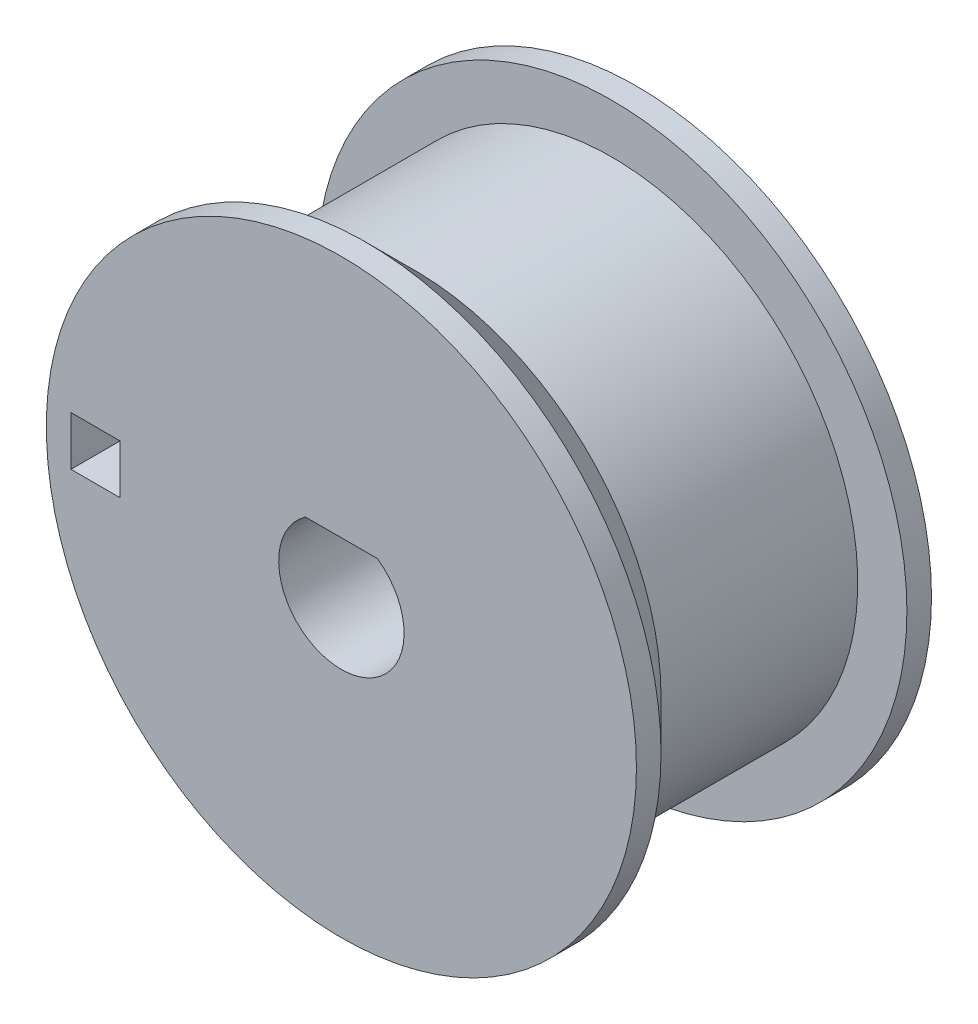
ISO-10303-21;
HEADER;
FILE_DESCRIPTION(('STEP AP214'),'2;1');
FILE_NAME('part.step','',(''),(''),'','','');
FILE_SCHEMA(('AUTOMOTIVE_DESIGN { 1 0 10303 214 1 1 1 1 }'));
ENDSEC;
DATA;
#1=APPLICATION_CONTEXT('core data for automotive mechanical design processes');
#2=APPLICATION_PROTOCOL_DEFINITION('international standard','automotive_design',2000,#1);
#3=PRODUCT_CONTEXT('',#1,'mechanical');
#4=PRODUCT('Part','Part','',(#3));
#5=PRODUCT_RELATED_PRODUCT_CATEGORY('part','',(#4));
#6=PRODUCT_DEFINITION_FORMATION('','',#4);
#7=PRODUCT_DEFINITION_CONTEXT('part definition',#1,'design');
#8=PRODUCT_DEFINITION('design','',#6,#7);
#9=PRODUCT_DEFINITION_SHAPE('','',#8);
#10=(LENGTH_UNIT() NAMED_UNIT(*) SI_UNIT(.MILLI.,.METRE.));
#11=(NAMED_UNIT(*) PLANE_ANGLE_UNIT() SI_UNIT($,.RADIAN.));
#12=(NAMED_UNIT(*) SI_UNIT($,.STERADIAN.) SOLID_ANGLE_UNIT());
#13=UNCERTAINTY_MEASURE_WITH_UNIT(LENGTH_MEASURE(1.E-05),#10,'distance_accuracy_value','');
#14=(GEOMETRIC_REPRESENTATION_CONTEXT(3) GLOBAL_UNCERTAINTY_ASSIGNED_CONTEXT((#13)) GLOBAL_UNIT_ASSIGNED_CONTEXT((#10,
#11,#12)) REPRESENTATION_CONTEXT('',''));
#15=CARTESIAN_POINT('',(0.,0.,0.));
#16=DIRECTION('',(0.,0.,1.));
#17=DIRECTION('',(1.,0.,0.));
#18=AXIS2_PLACEMENT_3D('',#15,#16,#17);
#19=CARTESIAN_POINT('',(-1.42912560679596,-37.91,332.000000000001));
#20=DIRECTION('',(0.,-1.,0.));
#21=DIRECTION('',(1.,0.,0.));
#22=AXIS2_PLACEMENT_3D('',#19,#20,#21);
#23=PLANE('',#22);
#24=DIRECTION('',(1.,0.,0.));
#25=VECTOR('',#24,1.);
#26=CARTESIAN_POINT('',(0.,-37.91,344.000000000001));
#27=LINE('',#26,#25);
#28=CARTESIAN_POINT('',(1.46095858942,-37.91,344.000000000001));
#29=VERTEX_POINT('',#28);
#30=CARTESIAN_POINT('',(-1.46095858941995,-37.91,344.000000000001));
#31=VERTEX_POINT('',#30);
#32=EDGE_CURVE('E139',#29,#31,#27,.F.);
#33=ORIENTED_EDGE('',*,*,#32,.T.);
#34=DIRECTION('',(0.,0.,1.));
#35=VECTOR('',#34,1.);
#36=CARTESIAN_POINT('',(-1.46095858941995,-37.91,332.000000000001));
#37=LINE('',#36,#35);
#38=CARTESIAN_POINT('',(-1.46095858941995,-37.91,332.000000000001));
#39=VERTEX_POINT('',#38);
#40=EDGE_CURVE('E70',#31,#39,#37,.F.);
#41=ORIENTED_EDGE('',*,*,#40,.T.);
#42=DIRECTION('',(1.,0.,0.));
#43=VECTOR('',#42,1.);
#44=CARTESIAN_POINT('',(0.,-37.91,332.000000000001));
#45=LINE('',#44,#43);
#46=CARTESIAN_POINT('',(1.46095858942,-37.91,332.000000000001));
#47=VERTEX_POINT('',#46);
#48=EDGE_CURVE('E83',#47,#39,#45,.F.);
#49=ORIENTED_EDGE('',*,*,#48,.F.);
#50=DIRECTION('',(0.,0.,1.));
#51=VECTOR('',#50,1.);
#52=CARTESIAN_POINT('',(1.46095858942,-37.91,332.000000000001));
#53=LINE('',#52,#51);
#54=EDGE_CURVE('E75',#47,#29,#53,.T.);
#55=ORIENTED_EDGE('',*,*,#54,.T.);
#56=EDGE_LOOP('',(#33,#41,#49,#55));
#57=FACE_BOUND('',#56,.T.);
#58=ADVANCED_FACE('F16',(#57),#23,.T.);
#59=CARTESIAN_POINT('',(0.,-40.,332.000000000001));
#60=DIRECTION('',(0.,0.,1.));
#61=DIRECTION('',(1.,0.,0.));
#62=AXIS2_PLACEMENT_3D('',#59,#60,#61);
#63=CYLINDRICAL_SURFACE('',#62,2.55);
#64=ORIENTED_EDGE('',*,*,#40,.F.);
#65=CARTESIAN_POINT('',(0.,-40.,344.000000000001));
#66=DIRECTION('',(0.,0.,1.));
#67=DIRECTION('',(1.,0.,0.));
#68=AXIS2_PLACEMENT_3D('',#65,#66,#67);
#69=CIRCLE('',#68,2.55);
#70=EDGE_CURVE('E80',#31,#29,#69,.T.);
#71=ORIENTED_EDGE('',*,*,#70,.T.);
#72=ORIENTED_EDGE('',*,*,#54,.F.);
#73=CARTESIAN_POINT('',(0.,-40.,332.000000000001));
#74=DIRECTION('',(0.,0.,1.));
#75=DIRECTION('',(1.,0.,0.));
#76=AXIS2_PLACEMENT_3D('',#73,#74,#75);
#77=CIRCLE('',#76,2.55);
#78=EDGE_CURVE('E19',#39,#47,#77,.T.);
#79=ORIENTED_EDGE('',*,*,#78,.F.);
#80=EDGE_LOOP('',(#64,#71,#72,#79));
#81=FACE_BOUND('',#80,.T.);
#82=ADVANCED_FACE('F76',(#81),#63,.F.);
#83=CARTESIAN_POINT('',(0.,-40.,343.000000000001));
#84=DIRECTION('',(0.,0.,1.));
#85=DIRECTION('',(1.,0.,0.));
#86=AXIS2_PLACEMENT_3D('',#83,#84,#85);
#87=CYLINDRICAL_SURFACE('',#86,12.);
#88=CARTESIAN_POINT('',(0.,-40.,343.000000000001));
#89=DIRECTION('',(0.,0.,1.));
#90=DIRECTION('',(1.,0.,0.));
#91=AXIS2_PLACEMENT_3D('',#88,#89,#90);
#92=CIRCLE('',#91,12.);
#93=CARTESIAN_POINT('',(12.,-40.,343.000000000001));
#94=VERTEX_POINT('',#93);
#95=EDGE_CURVE('E132',#94,#94,#92,.F.);
#96=ORIENTED_EDGE('',*,*,#95,.F.);
#97=EDGE_LOOP('',(#96));
#98=FACE_BOUND('',#97,.T.);
#99=CARTESIAN_POINT('',(0.,-40.,344.000000000001));
#100=DIRECTION('',(0.,0.,1.));
#101=DIRECTION('',(1.,0.,0.));
#102=AXIS2_PLACEMENT_3D('',#99,#100,#101);
#103=CIRCLE('',#102,12.);
#104=CARTESIAN_POINT('',(12.,-40.,344.000000000001));
#105=VERTEX_POINT('',#104);
#106=EDGE_CURVE('E140',#105,#105,#103,.F.);
#107=ORIENTED_EDGE('',*,*,#106,.T.);
#108=EDGE_LOOP('',(#107));
#109=FACE_BOUND('',#108,.T.);
#110=ADVANCED_FACE('F348',(#98,#109),#87,.T.);
#111=CARTESIAN_POINT('',(0.,-40.,332.000000000001));
#112=DIRECTION('',(0.,0.,-1.));
#113=DIRECTION('',(0.,1.,0.));
#114=AXIS2_PLACEMENT_3D('',#111,#112,#113);
#115=PLANE('',#114);
#116=ORIENTED_EDGE('',*,*,#78,.T.);
#117=ORIENTED_EDGE('',*,*,#48,.T.);
#118=EDGE_LOOP('',(#116,#117));
#119=FACE_BOUND('',#118,.T.);
#120=DIRECTION('',(0.,1.,0.));
#121=VECTOR('',#120,1.);
#122=CARTESIAN_POINT('',(-8.99999999999997,-39.,332.000000000001));
#123=LINE('',#122,#121);
#124=CARTESIAN_POINT('',(-8.99999999999997,-41.,332.000000000001));
#125=VERTEX_POINT('',#124);
#126=CARTESIAN_POINT('',(-8.99999999999997,-39.,332.000000000001));
#127=VERTEX_POINT('',#126);
#128=EDGE_CURVE('E85',#125,#127,#123,.T.);
#129=ORIENTED_EDGE('',*,*,#128,.T.);
#130=DIRECTION('',(-1.,0.,0.));
#131=VECTOR('',#130,1.);
#132=CARTESIAN_POINT('',(-11.,-39.,332.000000000001));
#133=LINE('',#132,#131);
#134=CARTESIAN_POINT('',(-11.,-39.,332.000000000001));
#135=VERTEX_POINT('',#134);
#136=EDGE_CURVE('E178',#127,#135,#133,.T.);
#137=ORIENTED_EDGE('',*,*,#136,.T.);
#138=DIRECTION('',(0.,-1.,0.));
#139=VECTOR('',#138,1.);
#140=CARTESIAN_POINT('',(-11.,-41.,332.000000000001));
#141=LINE('',#140,#139);
#142=CARTESIAN_POINT('',(-11.,-41.,332.000000000001));
#143=VERTEX_POINT('',#142);
#144=EDGE_CURVE('E137',#135,#143,#141,.T.);
#145=ORIENTED_EDGE('',*,*,#144,.T.);
#146=DIRECTION('',(1.,0.,0.));
#147=VECTOR('',#146,1.);
#148=CARTESIAN_POINT('',(-8.99999999999997,-41.,332.000000000001));
#149=LINE('',#148,#147);
#150=EDGE_CURVE('E160',#143,#125,#149,.T.);
#151=ORIENTED_EDGE('',*,*,#150,.T.);
#152=EDGE_LOOP('',(#129,#137,#145,#151));
#153=FACE_BOUND('',#152,.T.);
#154=CARTESIAN_POINT('',(0.,-40.,332.000000000001));
#155=DIRECTION('',(0.,0.,1.));
#156=DIRECTION('',(1.,0.,0.));
#157=AXIS2_PLACEMENT_3D('',#154,#155,#156);
#158=CIRCLE('',#157,12.);
#159=CARTESIAN_POINT('',(12.,-40.,332.000000000001));
#160=VERTEX_POINT('',#159);
#161=EDGE_CURVE('E134',#160,#160,#158,.T.);
#162=ORIENTED_EDGE('',*,*,#161,.F.);
#163=EDGE_LOOP('',(#162));
#164=FACE_BOUND('',#163,.T.);
#165=ADVANCED_FACE('F87',(#119,#153,#164),#115,.T.);
#166=CARTESIAN_POINT('',(-8.99999999999997,-39.,344.000000000001));
#167=DIRECTION('',(1.,0.,0.));
#168=DIRECTION('',(0.,1.,0.));
#169=AXIS2_PLACEMENT_3D('',#166,#167,#168);
#170=PLANE('',#169);
#171=DIRECTION('',(0.,0.,-1.));
#172=VECTOR('',#171,1.);
#173=CARTESIAN_POINT('',(-8.99999999999997,-41.,344.000000000001));
#174=LINE('',#173,#172);
#175=CARTESIAN_POINT('',(-8.99999999999997,-41.,344.000000000001));
#176=VERTEX_POINT('',#175);
#177=EDGE_CURVE('E162',#125,#176,#174,.F.);
#178=ORIENTED_EDGE('',*,*,#177,.T.);
#179=DIRECTION('',(0.,1.,0.));
#180=VECTOR('',#179,1.);
#181=CARTESIAN_POINT('',(-8.99999999999997,-40.,344.000000000001));
#182=LINE('',#181,#180);
#183=CARTESIAN_POINT('',(-8.99999999999997,-39.,344.000000000001));
#184=VERTEX_POINT('',#183);
#185=EDGE_CURVE('E142',#176,#184,#182,.T.);
#186=ORIENTED_EDGE('',*,*,#185,.T.);
#187=DIRECTION('',(0.,0.,1.));
#188=VECTOR('',#187,1.);
#189=CARTESIAN_POINT('',(-8.99999999999997,-39.,344.000000000001));
#190=LINE('',#189,#188);
#191=EDGE_CURVE('E180',#184,#127,#190,.F.);
#192=ORIENTED_EDGE('',*,*,#191,.T.);
#193=ORIENTED_EDGE('',*,*,#128,.F.);
#194=EDGE_LOOP('',(#178,#186,#192,#193));
#195=FACE_BOUND('',#194,.T.);
#196=ADVANCED_FACE('F207',(#195),#170,.F.);
#197=CARTESIAN_POINT('',(0.,-40.,344.000000000001));
#198=DIRECTION('',(0.,0.,-1.));
#199=DIRECTION('',(0.,1.,0.));
#200=AXIS2_PLACEMENT_3D('',#197,#198,#199);
#201=PLANE('',#200);
#202=ORIENTED_EDGE('',*,*,#32,.F.);
#203=ORIENTED_EDGE('',*,*,#70,.F.);
#204=EDGE_LOOP('',(#202,#203));
#205=FACE_BOUND('',#204,.T.);
#206=DIRECTION('',(-1.,0.,0.));
#207=VECTOR('',#206,1.);
#208=CARTESIAN_POINT('',(-11.,-39.,344.000000000001));
#209=LINE('',#208,#207);
#210=CARTESIAN_POINT('',(-11.,-39.,344.000000000001));
#211=VERTEX_POINT('',#210);
#212=EDGE_CURVE('E175',#211,#184,#209,.F.);
#213=ORIENTED_EDGE('',*,*,#212,.T.);
#214=ORIENTED_EDGE('',*,*,#185,.F.);
#215=DIRECTION('',(1.,0.,0.));
#216=VECTOR('',#215,1.);
#217=CARTESIAN_POINT('',(-8.99999999999997,-41.,344.000000000001));
#218=LINE('',#217,#216);
#219=CARTESIAN_POINT('',(-11.,-41.,344.000000000001));
#220=VERTEX_POINT('',#219);
#221=EDGE_CURVE('E256',#176,#220,#218,.F.);
#222=ORIENTED_EDGE('',*,*,#221,.T.);
#223=DIRECTION('',(0.,-1.,0.));
#224=VECTOR('',#223,1.);
#225=CARTESIAN_POINT('',(-11.,-41.,344.000000000001));
#226=LINE('',#225,#224);
#227=EDGE_CURVE('E138',#220,#211,#226,.F.);
#228=ORIENTED_EDGE('',*,*,#227,.T.);
#229=EDGE_LOOP('',(#213,#214,#222,#228));
#230=FACE_BOUND('',#229,.T.);
#231=ORIENTED_EDGE('',*,*,#106,.F.);
#232=EDGE_LOOP('',(#231));
#233=FACE_BOUND('',#232,.T.);
#234=ADVANCED_FACE('F194',(#205,#230,#233),#201,.F.);
#235=CARTESIAN_POINT('',(-11.,-41.,344.000000000001));
#236=DIRECTION('',(-1.,0.,0.));
#237=DIRECTION('',(0.,-1.,0.));
#238=AXIS2_PLACEMENT_3D('',#235,#236,#237);
#239=PLANE('',#238);
#240=DIRECTION('',(0.,0.,1.));
#241=VECTOR('',#240,1.);
#242=CARTESIAN_POINT('',(-11.,-39.,344.000000000001));
#243=LINE('',#242,#241);
#244=CARTESIAN_POINT('',(-11.,-39.0000000094459,342.045361016333));
#245=VERTEX_POINT('',#244);
#246=EDGE_CURVE('E168',#245,#211,#243,.T.);
#247=ORIENTED_EDGE('',*,*,#246,.T.);
#248=ORIENTED_EDGE('',*,*,#227,.F.);
#249=DIRECTION('',(0.,0.,-1.));
#250=VECTOR('',#249,1.);
#251=CARTESIAN_POINT('',(-11.,-41.,344.000000000001));
#252=LINE('',#251,#250);
#253=CARTESIAN_POINT('',(-11.,-40.9999999968515,342.045361016903));
#254=VERTEX_POINT('',#253);
#255=EDGE_CURVE('E104',#220,#254,#252,.T.);
#256=ORIENTED_EDGE('',*,*,#255,.T.);
#257=CARTESIAN_POINT('',(-10.9999999295796,-39.0000000215371,342.045361044697));
#258=CARTESIAN_POINT('',(-10.9999999647898,-39.3333333474743,342.015120353124));
#259=CARTESIAN_POINT('',(-10.9999999882633,-39.6666666736286,342.000000004892));
#260=CARTESIAN_POINT('',(-11.0000000117367,-40.3333333310173,341.999999995111));
#261=CARTESIAN_POINT('',(-11.0000000117367,-40.6666666622516,342.015120333983));
#262=CARTESIAN_POINT('',(-11.,-40.9999999937029,342.045361016618));
#263=B_SPLINE_CURVE_WITH_KNOTS('',3,(#257,#258,#259,#260,#261,#262),.UNSPECIFIED.,.F.,.F.,(4,2,
4),(0.,1.00102826198951,2.002056537931),.UNSPECIFIED.);
#264=EDGE_CURVE('E105',#245,#254,#263,.T.);
#265=ORIENTED_EDGE('',*,*,#264,.F.);
#266=EDGE_LOOP('',(#247,#248,#256,#265));
#267=FACE_BOUND('',#266,.T.);
#268=ADVANCED_FACE('F275',(#267),#239,.F.);
#269=CARTESIAN_POINT('',(0.,-40.,332.000000000001));
#270=DIRECTION('',(0.,0.,1.));
#271=DIRECTION('',(1.,0.,0.));
#272=AXIS2_PLACEMENT_3D('',#269,#270,#271);
#273=CYLINDRICAL_SURFACE('',#272,12.);
#274=ORIENTED_EDGE('',*,*,#161,.T.);
#275=EDGE_LOOP('',(#274));
#276=FACE_BOUND('',#275,.T.);
#277=CARTESIAN_POINT('',(0.,-40.,333.000000000001));
#278=DIRECTION('',(0.,0.,1.));
#279=DIRECTION('',(1.,0.,0.));
#280=AXIS2_PLACEMENT_3D('',#277,#278,#279);
#281=CIRCLE('',#280,12.);
#282=CARTESIAN_POINT('',(12.,-40.,333.000000000001));
#283=VERTEX_POINT('',#282);
#284=EDGE_CURVE('E92',#283,#283,#281,.F.);
#285=ORIENTED_EDGE('',*,*,#284,.T.);
#286=EDGE_LOOP('',(#285));
#287=FACE_BOUND('',#286,.T.);
#288=ADVANCED_FACE('F277',(#276,#287),#273,.T.);
#289=CARTESIAN_POINT('',(-11.,-41.,344.000000000001));
#290=DIRECTION('',(-1.,0.,0.));
#291=DIRECTION('',(0.,-1.,0.));
#292=AXIS2_PLACEMENT_3D('',#289,#290,#291);
#293=PLANE('',#292);
#294=DIRECTION('',(0.,0.,-1.));
#295=VECTOR('',#294,1.);
#296=CARTESIAN_POINT('',(-11.,-41.,344.000000000001));
#297=LINE('',#296,#295);
#298=CARTESIAN_POINT('',(-11.,-41.,333.000000000001));
#299=VERTEX_POINT('',#298);
#300=EDGE_CURVE('E163',#299,#143,#297,.T.);
#301=ORIENTED_EDGE('',*,*,#300,.T.);
#302=ORIENTED_EDGE('',*,*,#144,.F.);
#303=DIRECTION('',(0.,0.,1.));
#304=VECTOR('',#303,1.);
#305=CARTESIAN_POINT('',(-11.,-39.,344.000000000001));
#306=LINE('',#305,#304);
#307=CARTESIAN_POINT('',(-11.,-39.,333.000000000001));
#308=VERTEX_POINT('',#307);
#309=EDGE_CURVE('E133',#135,#308,#306,.T.);
#310=ORIENTED_EDGE('',*,*,#309,.T.);
#311=DIRECTION('',(0.,1.,0.));
#312=VECTOR('',#311,1.);
#313=CARTESIAN_POINT('',(-11.,-40.,333.000000000001));
#314=LINE('',#313,#312);
#315=EDGE_CURVE('E95',#308,#299,#314,.F.);
#316=ORIENTED_EDGE('',*,*,#315,.T.);
#317=EDGE_LOOP('',(#301,#302,#310,#316));
#318=FACE_BOUND('',#317,.T.);
#319=ADVANCED_FACE('F221',(#318),#293,.F.);
#320=CARTESIAN_POINT('',(-11.,-39.,344.000000000001));
#321=DIRECTION('',(0.,1.,0.));
#322=DIRECTION('',(-1.,0.,0.));
#323=AXIS2_PLACEMENT_3D('',#320,#321,#322);
#324=PLANE('',#323);
#325=DIRECTION('',(0.,0.,1.));
#326=VECTOR('',#325,1.);
#327=CARTESIAN_POINT('',(-9.94987437106617,-39.,332.000000000001));
#328=LINE('',#327,#326);
#329=CARTESIAN_POINT('',(-9.94987437106617,-39.,333.000000000001));
#330=VERTEX_POINT('',#329);
#331=CARTESIAN_POINT('',(-9.94987437106617,-39.,341.000000000001));
#332=VERTEX_POINT('',#331);
#333=EDGE_CURVE('E235',#330,#332,#328,.T.);
#334=ORIENTED_EDGE('',*,*,#333,.F.);
#335=DIRECTION('',(1.,0.,0.));
#336=VECTOR('',#335,1.);
#337=CARTESIAN_POINT('',(0.,-39.,333.000000000001));
#338=LINE('',#337,#336);
#339=EDGE_CURVE('E233',#330,#308,#338,.F.);
#340=ORIENTED_EDGE('',*,*,#339,.T.);
#341=ORIENTED_EDGE('',*,*,#309,.F.);
#342=ORIENTED_EDGE('',*,*,#136,.F.);
#343=ORIENTED_EDGE('',*,*,#191,.F.);
#344=ORIENTED_EDGE('',*,*,#212,.F.);
#345=ORIENTED_EDGE('',*,*,#246,.F.);
#346=CARTESIAN_POINT('',(-9.94987437106618,-39.,341.000000000001));
#347=CARTESIAN_POINT('',(-10.1249348197619,-39.,341.174187098746));
#348=CARTESIAN_POINT('',(-10.2999755014829,-39.,341.348394054561));
#349=CARTESIAN_POINT('',(-10.6500173307518,-39.,341.696847680108));
#350=CARTESIAN_POINT('',(-10.8250184782998,-39.,341.87109434984));
#351=CARTESIAN_POINT('',(-10.9999998588731,-39.,342.045360876641));
#352=B_SPLINE_CURVE_WITH_KNOTS('',3,(#346,#347,#348,#349,#350,#351),.UNSPECIFIED.,.F.,.F.,(4,2,
4),(0.,0.74086822944775,1.48173645794809),.UNSPECIFIED.);
#353=EDGE_CURVE('E125',#332,#245,#352,.T.);
#354=ORIENTED_EDGE('',*,*,#353,.F.);
#355=EDGE_LOOP('',(#334,#340,#341,#342,#343,#344,#345,#354));
#356=FACE_BOUND('',#355,.T.);
#357=ADVANCED_FACE('F119',(#356),#324,.F.);
#358=CARTESIAN_POINT('',(0.,-40.,343.000000000001));
#359=DIRECTION('',(0.,0.,1.));
#360=DIRECTION('',(1.,0.,0.));
#361=AXIS2_PLACEMENT_3D('',#358,#359,#360);
#362=CONICAL_SURFACE('',#361,12.,0.785398163397442);
#363=ORIENTED_EDGE('',*,*,#95,.T.);
#364=EDGE_LOOP('',(#363));
#365=FACE_BOUND('',#364,.T.);
#366=CARTESIAN_POINT('',(-10.9999999894881,-41.0000000108235,342.045360992393));
#367=CARTESIAN_POINT('',(-10.8250185847668,-41.0000000054118,341.871094448689));
#368=CARTESIAN_POINT('',(-10.6500174142603,-41.0000000018039,341.69684776086));
#369=CARTESIAN_POINT('',(-10.2999755414531,-40.9999999981961,341.348394096729));
#370=CARTESIAN_POINT('',(-10.1249348391522,-40.9999999981961,341.174187120427));
#371=CARTESIAN_POINT('',(-9.94987437106617,-41.,341.000000000001));
#372=B_SPLINE_CURVE_WITH_KNOTS('',3,(#366,#367,#368,#369,#370,#371),.UNSPECIFIED.,.F.,.F.,(4,2,
4),(0.,0.740868315614723,1.48173663217793),.UNSPECIFIED.);
#373=CARTESIAN_POINT('',(-9.94987437106617,-41.,341.000000000001));
#374=VERTEX_POINT('',#373);
#375=EDGE_CURVE('E96',#254,#374,#372,.T.);
#376=ORIENTED_EDGE('',*,*,#375,.T.);
#377=CARTESIAN_POINT('',(0.,-40.,341.000000000001));
#378=DIRECTION('',(0.,0.,1.));
#379=DIRECTION('',(1.,0.,0.));
#380=AXIS2_PLACEMENT_3D('',#377,#378,#379);
#381=CIRCLE('',#380,10.);
#382=EDGE_CURVE('E243',#332,#374,#381,.F.);
#383=ORIENTED_EDGE('',*,*,#382,.F.);
#384=ORIENTED_EDGE('',*,*,#353,.T.);
#385=ORIENTED_EDGE('',*,*,#264,.T.);
#386=EDGE_LOOP('',(#376,#383,#384,#385));
#387=FACE_BOUND('',#386,.T.);
#388=ADVANCED_FACE('F115',(#365,#387),#362,.T.);
#389=CARTESIAN_POINT('',(-8.99999999999997,-41.,344.000000000001));
#390=DIRECTION('',(0.,-1.,0.));
#391=DIRECTION('',(0.,0.,-1.));
#392=AXIS2_PLACEMENT_3D('',#389,#390,#391);
#393=PLANE('',#392);
#394=ORIENTED_EDGE('',*,*,#255,.F.);
#395=ORIENTED_EDGE('',*,*,#221,.F.);
#396=ORIENTED_EDGE('',*,*,#177,.F.);
#397=ORIENTED_EDGE('',*,*,#150,.F.);
#398=ORIENTED_EDGE('',*,*,#300,.F.);
#399=DIRECTION('',(1.,0.,0.));
#400=VECTOR('',#399,1.);
#401=CARTESIAN_POINT('',(0.,-41.,333.000000000001));
#402=LINE('',#401,#400);
#403=CARTESIAN_POINT('',(-9.94987437106617,-41.,333.000000000001));
#404=VERTEX_POINT('',#403);
#405=EDGE_CURVE('E34',#299,#404,#402,.T.);
#406=ORIENTED_EDGE('',*,*,#405,.T.);
#407=DIRECTION('',(0.,0.,1.));
#408=VECTOR('',#407,1.);
#409=CARTESIAN_POINT('',(-9.94987437106617,-41.,332.000000000001));
#410=LINE('',#409,#408);
#411=EDGE_CURVE('E25',#374,#404,#410,.F.);
#412=ORIENTED_EDGE('',*,*,#411,.F.);
#413=ORIENTED_EDGE('',*,*,#375,.F.);
#414=EDGE_LOOP('',(#394,#395,#396,#397,#398,#406,#412,#413));
#415=FACE_BOUND('',#414,.T.);
#416=ADVANCED_FACE('F112',(#415),#393,.F.);
#417=CARTESIAN_POINT('',(0.,-40.,333.000000000001));
#418=DIRECTION('',(0.,0.,-1.));
#419=DIRECTION('',(0.,1.,0.));
#420=AXIS2_PLACEMENT_3D('',#417,#418,#419);
#421=PLANE('',#420);
#422=CARTESIAN_POINT('',(0.,-40.,333.000000000001));
#423=DIRECTION('',(0.,0.,1.));
#424=DIRECTION('',(1.,0.,0.));
#425=AXIS2_PLACEMENT_3D('',#422,#423,#424);
#426=CIRCLE('',#425,10.);
#427=EDGE_CURVE('E11',#404,#330,#426,.T.);
#428=ORIENTED_EDGE('',*,*,#427,.F.);
#429=ORIENTED_EDGE('',*,*,#405,.F.);
#430=ORIENTED_EDGE('',*,*,#315,.F.);
#431=ORIENTED_EDGE('',*,*,#339,.F.);
#432=EDGE_LOOP('',(#428,#429,#430,#431));
#433=FACE_BOUND('',#432,.T.);
#434=ORIENTED_EDGE('',*,*,#284,.F.);
#435=EDGE_LOOP('',(#434));
#436=FACE_BOUND('',#435,.T.);
#437=ADVANCED_FACE('F230',(#433,#436),#421,.F.);
#438=CARTESIAN_POINT('',(0.,-40.,332.000000000001));
#439=DIRECTION('',(0.,0.,1.));
#440=DIRECTION('',(1.,0.,0.));
#441=AXIS2_PLACEMENT_3D('',#438,#439,#440);
#442=CYLINDRICAL_SURFACE('',#441,10.);
#443=ORIENTED_EDGE('',*,*,#411,.T.);
#444=ORIENTED_EDGE('',*,*,#427,.T.);
#445=ORIENTED_EDGE('',*,*,#333,.T.);
#446=ORIENTED_EDGE('',*,*,#382,.T.);
#447=EDGE_LOOP('',(#443,#444,#445,#446));
#448=FACE_BOUND('',#447,.T.);
#449=ADVANCED_FACE('F269',(#448),#442,.T.);
#450=CLOSED_SHELL('',(#58,#82,#110,#165,#196,#234,#268,#288,#319,#357,#388,#416,#437,#449));
#451=MANIFOLD_SOLID_BREP('B1',#450);
#452=ADVANCED_BREP_SHAPE_REPRESENTATION('',(#18,#451),#14);
#453=SHAPE_DEFINITION_REPRESENTATION(#9,#452);
ENDSEC;
END-ISO-10303-21;
